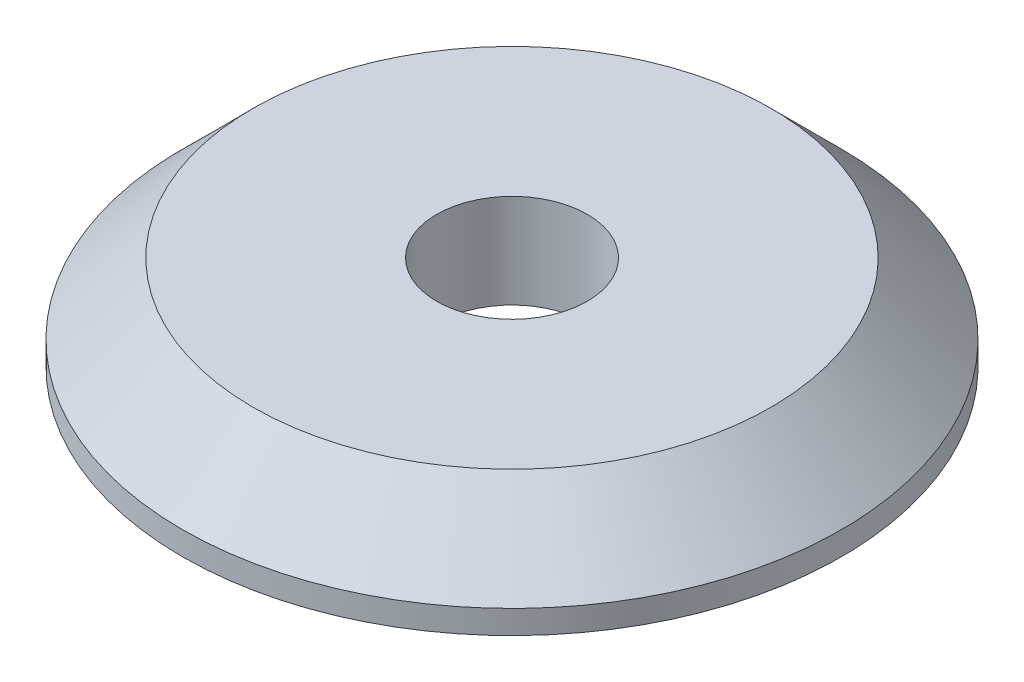
ISO-10303-21;
HEADER;
FILE_DESCRIPTION(('STEP AP214'),'2;1');
FILE_NAME('part.step','',(''),(''),'','','');
FILE_SCHEMA(('AUTOMOTIVE_DESIGN { 1 0 10303 214 1 1 1 1 }'));
ENDSEC;
DATA;
#1=APPLICATION_CONTEXT('core data for automotive mechanical design processes');
#2=APPLICATION_PROTOCOL_DEFINITION('international standard','automotive_design',2000,#1);
#3=PRODUCT_CONTEXT('',#1,'mechanical');
#4=PRODUCT('Part','Part','',(#3));
#5=PRODUCT_RELATED_PRODUCT_CATEGORY('part','',(#4));
#6=PRODUCT_DEFINITION_FORMATION('','',#4);
#7=PRODUCT_DEFINITION_CONTEXT('part definition',#1,'design');
#8=PRODUCT_DEFINITION('design','',#6,#7);
#9=PRODUCT_DEFINITION_SHAPE('','',#8);
#10=(LENGTH_UNIT() NAMED_UNIT(*) SI_UNIT(.MILLI.,.METRE.));
#11=(NAMED_UNIT(*) PLANE_ANGLE_UNIT() SI_UNIT($,.RADIAN.));
#12=(NAMED_UNIT(*) SI_UNIT($,.STERADIAN.) SOLID_ANGLE_UNIT());
#13=UNCERTAINTY_MEASURE_WITH_UNIT(LENGTH_MEASURE(1.E-05),#10,'distance_accuracy_value','');
#14=(GEOMETRIC_REPRESENTATION_CONTEXT(3) GLOBAL_UNCERTAINTY_ASSIGNED_CONTEXT((#13)) GLOBAL_UNIT_ASSIGNED_CONTEXT((#10,
#11,#12)) REPRESENTATION_CONTEXT('',''));
#15=CARTESIAN_POINT('',(0.,0.,0.));
#16=DIRECTION('',(0.,0.,1.));
#17=DIRECTION('',(1.,0.,0.));
#18=AXIS2_PLACEMENT_3D('',#15,#16,#17);
#19=CARTESIAN_POINT('',(0.,2.,0.));
#20=DIRECTION('',(0.,-1.,0.));
#21=DIRECTION('',(0.,0.,-1.));
#22=AXIS2_PLACEMENT_3D('',#19,#20,#21);
#23=CYLINDRICAL_SURFACE('',#22,7.);
#24=CARTESIAN_POINT('',(0.,0.499999999999996,0.));
#25=DIRECTION('',(0.,1.,0.));
#26=DIRECTION('',(0.,0.,1.));
#27=AXIS2_PLACEMENT_3D('',#24,#25,#26);
#28=CIRCLE('',#27,7.);
#29=CARTESIAN_POINT('',(0.,0.499999999999996,7.));
#30=VERTEX_POINT('',#29);
#31=EDGE_CURVE('E12',#30,#30,#28,.F.);
#32=ORIENTED_EDGE('',*,*,#31,.T.);
#33=EDGE_LOOP('',(#32));
#34=FACE_BOUND('',#33,.T.);
#35=CARTESIAN_POINT('',(0.,0.,0.));
#36=DIRECTION('',(0.,1.,0.));
#37=DIRECTION('',(0.,0.,1.));
#38=AXIS2_PLACEMENT_3D('',#35,#36,#37);
#39=CIRCLE('',#38,7.);
#40=CARTESIAN_POINT('',(0.,0.,7.));
#41=VERTEX_POINT('',#40);
#42=EDGE_CURVE('E66',#41,#41,#39,.T.);
#43=ORIENTED_EDGE('',*,*,#42,.T.);
#44=EDGE_LOOP('',(#43));
#45=FACE_BOUND('',#44,.T.);
#46=ADVANCED_FACE('F50',(#34,#45),#23,.T.);
#47=CARTESIAN_POINT('',(0.,2.,0.));
#48=DIRECTION('',(0.,1.,0.));
#49=DIRECTION('',(0.,0.,1.));
#50=AXIS2_PLACEMENT_3D('',#47,#48,#49);
#51=PLANE('',#50);
#52=CARTESIAN_POINT('',(0.,2.,0.));
#53=DIRECTION('',(0.,-1.,0.));
#54=DIRECTION('',(0.,0.,-1.));
#55=AXIS2_PLACEMENT_3D('',#52,#53,#54);
#56=CIRCLE('',#55,1.6);
#57=CARTESIAN_POINT('',(0.,2.,-1.6));
#58=VERTEX_POINT('',#57);
#59=EDGE_CURVE('E72',#58,#58,#56,.T.);
#60=ORIENTED_EDGE('',*,*,#59,.T.);
#61=EDGE_LOOP('',(#60));
#62=FACE_BOUND('',#61,.T.);
#63=CARTESIAN_POINT('',(0.,2.,0.));
#64=DIRECTION('',(0.,1.,0.));
#65=DIRECTION('',(0.,0.,1.));
#66=AXIS2_PLACEMENT_3D('',#63,#64,#65);
#67=CIRCLE('',#66,5.5);
#68=CARTESIAN_POINT('',(0.,2.,5.5));
#69=VERTEX_POINT('',#68);
#70=EDGE_CURVE('E58',#69,#69,#67,.T.);
#71=ORIENTED_EDGE('',*,*,#70,.T.);
#72=EDGE_LOOP('',(#71));
#73=FACE_BOUND('',#72,.T.);
#74=ADVANCED_FACE('F84',(#62,#73),#51,.T.);
#75=CARTESIAN_POINT('',(0.,0.,0.));
#76=DIRECTION('',(0.,1.,0.));
#77=DIRECTION('',(0.,0.,1.));
#78=AXIS2_PLACEMENT_3D('',#75,#76,#77);
#79=PLANE('',#78);
#80=CARTESIAN_POINT('',(0.,0.,0.));
#81=DIRECTION('',(0.,-1.,0.));
#82=DIRECTION('',(0.,0.,-1.));
#83=AXIS2_PLACEMENT_3D('',#80,#81,#82);
#84=CIRCLE('',#83,1.6);
#85=CARTESIAN_POINT('',(0.,0.,-1.6));
#86=VERTEX_POINT('',#85);
#87=EDGE_CURVE('E75',#86,#86,#84,.T.);
#88=ORIENTED_EDGE('',*,*,#87,.F.);
#89=EDGE_LOOP('',(#88));
#90=FACE_BOUND('',#89,.T.);
#91=ORIENTED_EDGE('',*,*,#42,.F.);
#92=EDGE_LOOP('',(#91));
#93=FACE_BOUND('',#92,.T.);
#94=ADVANCED_FACE('F92',(#90,#93),#79,.F.);
#95=CARTESIAN_POINT('',(0.,2.,0.));
#96=DIRECTION('',(0.,-1.,0.));
#97=DIRECTION('',(0.,0.,-1.));
#98=AXIS2_PLACEMENT_3D('',#95,#96,#97);
#99=CONICAL_SURFACE('',#98,5.5,0.785398163397447);
#100=ORIENTED_EDGE('',*,*,#31,.F.);
#101=EDGE_LOOP('',(#100));
#102=FACE_BOUND('',#101,.T.);
#103=ORIENTED_EDGE('',*,*,#70,.F.);
#104=EDGE_LOOP('',(#103));
#105=FACE_BOUND('',#104,.T.);
#106=ADVANCED_FACE('F52',(#102,#105),#99,.T.);
#107=CARTESIAN_POINT('',(0.,2.,0.));
#108=DIRECTION('',(0.,-1.,0.));
#109=DIRECTION('',(0.,0.,-1.));
#110=AXIS2_PLACEMENT_3D('',#107,#108,#109);
#111=CYLINDRICAL_SURFACE('',#110,1.6);
#112=ORIENTED_EDGE('',*,*,#59,.F.);
#113=EDGE_LOOP('',(#112));
#114=FACE_BOUND('',#113,.T.);
#115=ORIENTED_EDGE('',*,*,#87,.T.);
#116=EDGE_LOOP('',(#115));
#117=FACE_BOUND('',#116,.T.);
#118=ADVANCED_FACE('F86',(#114,#117),#111,.F.);
#119=CLOSED_SHELL('',(#46,#74,#94,#106,#118));
#120=MANIFOLD_SOLID_BREP('B2',#119);
#121=ADVANCED_BREP_SHAPE_REPRESENTATION('',(#18,#120),#14);
#122=SHAPE_DEFINITION_REPRESENTATION(#9,#121);
ENDSEC;
END-ISO-10303-21;
